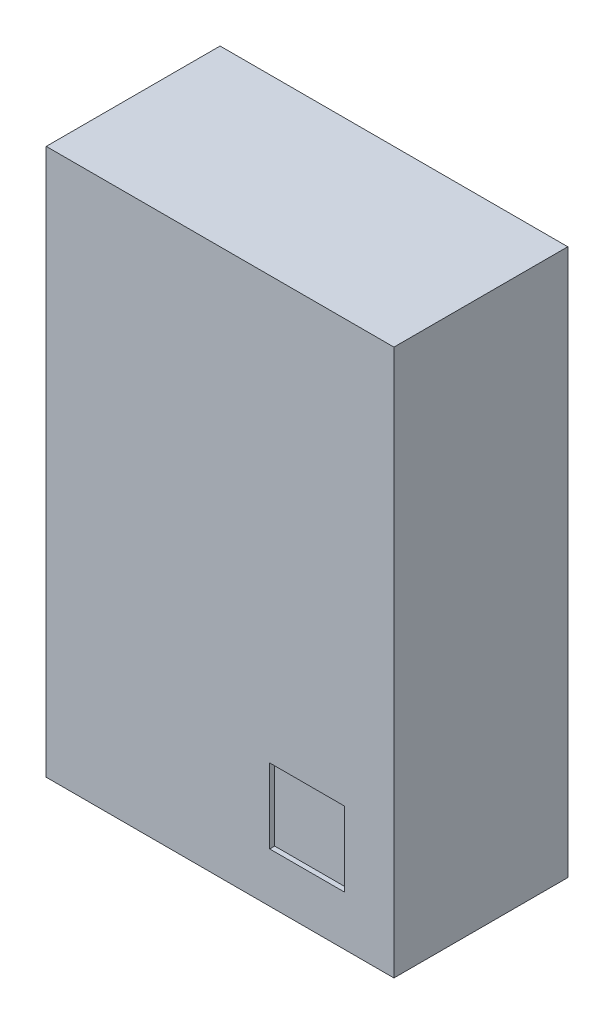
ISO-10303-21;
HEADER;
FILE_DESCRIPTION(('STEP AP214'),'2;1');
FILE_NAME('part.step','',(''),(''),'','','');
FILE_SCHEMA(('AUTOMOTIVE_DESIGN { 1 0 10303 214 1 1 1 1 }'));
ENDSEC;
DATA;
#1=APPLICATION_CONTEXT('core data for automotive mechanical design processes');
#2=APPLICATION_PROTOCOL_DEFINITION('international standard','automotive_design',2000,#1);
#3=PRODUCT_CONTEXT('',#1,'mechanical');
#4=PRODUCT('Part','Part','',(#3));
#5=PRODUCT_RELATED_PRODUCT_CATEGORY('part','',(#4));
#6=PRODUCT_DEFINITION_FORMATION('','',#4);
#7=PRODUCT_DEFINITION_CONTEXT('part definition',#1,'design');
#8=PRODUCT_DEFINITION('design','',#6,#7);
#9=PRODUCT_DEFINITION_SHAPE('','',#8);
#10=(LENGTH_UNIT() NAMED_UNIT(*) SI_UNIT(.MILLI.,.METRE.));
#11=(NAMED_UNIT(*) PLANE_ANGLE_UNIT() SI_UNIT($,.RADIAN.));
#12=(NAMED_UNIT(*) SI_UNIT($,.STERADIAN.) SOLID_ANGLE_UNIT());
#13=UNCERTAINTY_MEASURE_WITH_UNIT(LENGTH_MEASURE(1.E-05),#10,'distance_accuracy_value','');
#14=(GEOMETRIC_REPRESENTATION_CONTEXT(3) GLOBAL_UNCERTAINTY_ASSIGNED_CONTEXT((#13)) GLOBAL_UNIT_ASSIGNED_CONTEXT((#10,
#11,#12)) REPRESENTATION_CONTEXT('',''));
#15=CARTESIAN_POINT('',(0.,0.,0.));
#16=DIRECTION('',(0.,0.,1.));
#17=DIRECTION('',(1.,0.,0.));
#18=AXIS2_PLACEMENT_3D('',#15,#16,#17);
#19=CARTESIAN_POINT('',(0.,0.,0.));
#20=DIRECTION('',(0.,0.,1.));
#21=DIRECTION('',(1.,0.,0.));
#22=AXIS2_PLACEMENT_3D('',#19,#20,#21);
#23=PLANE('',#22);
#24=DIRECTION('',(0.,1.,0.));
#25=VECTOR('',#24,1.);
#26=CARTESIAN_POINT('',(-0.3,0.1,0.));
#27=LINE('',#26,#25);
#28=CARTESIAN_POINT('',(-0.3,-0.1,0.));
#29=VERTEX_POINT('',#28);
#30=CARTESIAN_POINT('',(-0.3,0.1,0.));
#31=VERTEX_POINT('',#30);
#32=EDGE_CURVE('E383',#29,#31,#27,.T.);
#33=ORIENTED_EDGE('',*,*,#32,.F.);
#34=DIRECTION('',(-1.,0.,0.));
#35=VECTOR('',#34,1.);
#36=CARTESIAN_POINT('',(-0.3,-0.1,0.));
#37=LINE('',#36,#35);
#38=CARTESIAN_POINT('',(-0.0999999999999999,-0.1,0.));
#39=VERTEX_POINT('',#38);
#40=EDGE_CURVE('E370',#39,#29,#37,.T.);
#41=ORIENTED_EDGE('',*,*,#40,.F.);
#42=DIRECTION('',(0.,-1.,0.));
#43=VECTOR('',#42,1.);
#44=CARTESIAN_POINT('',(-0.1,0.1,0.));
#45=LINE('',#44,#43);
#46=CARTESIAN_POINT('',(-0.1,0.1,0.));
#47=VERTEX_POINT('',#46);
#48=EDGE_CURVE('E374',#47,#39,#45,.T.);
#49=ORIENTED_EDGE('',*,*,#48,.F.);
#50=DIRECTION('',(1.,0.,0.));
#51=VECTOR('',#50,1.);
#52=CARTESIAN_POINT('',(-0.3,0.1,0.));
#53=LINE('',#52,#51);
#54=EDGE_CURVE('E379',#31,#47,#53,.T.);
#55=ORIENTED_EDGE('',*,*,#54,.F.);
#56=EDGE_LOOP('',(#33,#41,#49,#55));
#57=FACE_BOUND('',#56,.T.);
#58=DIRECTION('',(0.,-1.,0.));
#59=VECTOR('',#58,1.);
#60=CARTESIAN_POINT('',(0.3,-0.5,0.));
#61=LINE('',#60,#59);
#62=CARTESIAN_POINT('',(0.3,-0.3,0.));
#63=VERTEX_POINT('',#62);
#64=CARTESIAN_POINT('',(0.3,-0.5,0.));
#65=VERTEX_POINT('',#64);
#66=EDGE_CURVE('E473',#63,#65,#61,.T.);
#67=ORIENTED_EDGE('',*,*,#66,.F.);
#68=DIRECTION('',(1.,0.,0.));
#69=VECTOR('',#68,1.);
#70=CARTESIAN_POINT('',(0.3,-0.3,0.));
#71=LINE('',#70,#69);
#72=CARTESIAN_POINT('',(0.0999999999999999,-0.3,0.));
#73=VERTEX_POINT('',#72);
#74=EDGE_CURVE('E460',#73,#63,#71,.T.);
#75=ORIENTED_EDGE('',*,*,#74,.F.);
#76=DIRECTION('',(0.,1.,0.));
#77=VECTOR('',#76,1.);
#78=CARTESIAN_POINT('',(0.0999999999999998,-0.5,0.));
#79=LINE('',#78,#77);
#80=CARTESIAN_POINT('',(0.0999999999999998,-0.5,0.));
#81=VERTEX_POINT('',#80);
#82=EDGE_CURVE('E464',#81,#73,#79,.T.);
#83=ORIENTED_EDGE('',*,*,#82,.F.);
#84=DIRECTION('',(-1.,0.,0.));
#85=VECTOR('',#84,1.);
#86=CARTESIAN_POINT('',(0.3,-0.5,0.));
#87=LINE('',#86,#85);
#88=EDGE_CURVE('E469',#65,#81,#87,.T.);
#89=ORIENTED_EDGE('',*,*,#88,.F.);
#90=EDGE_LOOP('',(#67,#75,#83,#89));
#91=FACE_BOUND('',#90,.T.);
#92=DIRECTION('',(0.,1.,0.));
#93=VECTOR('',#92,1.);
#94=CARTESIAN_POINT('',(0.1,0.5,0.));
#95=LINE('',#94,#93);
#96=CARTESIAN_POINT('',(0.1,0.3,0.));
#97=VERTEX_POINT('',#96);
#98=CARTESIAN_POINT('',(0.1,0.5,0.));
#99=VERTEX_POINT('',#98);
#100=EDGE_CURVE('E522',#97,#99,#95,.T.);
#101=ORIENTED_EDGE('',*,*,#100,.F.);
#102=DIRECTION('',(-1.,0.,0.));
#103=VECTOR('',#102,1.);
#104=CARTESIAN_POINT('',(0.3,0.3,0.));
#105=LINE('',#104,#103);
#106=CARTESIAN_POINT('',(0.3,0.3,0.));
#107=VERTEX_POINT('',#106);
#108=EDGE_CURVE('E539',#107,#97,#105,.T.);
#109=ORIENTED_EDGE('',*,*,#108,.F.);
#110=DIRECTION('',(0.,-1.,0.));
#111=VECTOR('',#110,1.);
#112=CARTESIAN_POINT('',(0.3,0.5,0.));
#113=LINE('',#112,#111);
#114=CARTESIAN_POINT('',(0.3,0.5,0.));
#115=VERTEX_POINT('',#114);
#116=EDGE_CURVE('E556',#115,#107,#113,.T.);
#117=ORIENTED_EDGE('',*,*,#116,.F.);
#118=DIRECTION('',(1.,0.,0.));
#119=VECTOR('',#118,1.);
#120=CARTESIAN_POINT('',(0.3,0.5,0.));
#121=LINE('',#120,#119);
#122=EDGE_CURVE('E552',#99,#115,#121,.T.);
#123=ORIENTED_EDGE('',*,*,#122,.F.);
#124=EDGE_LOOP('',(#101,#109,#117,#123));
#125=FACE_BOUND('',#124,.T.);
#126=DIRECTION('',(0.,1.,0.));
#127=VECTOR('',#126,1.);
#128=CARTESIAN_POINT('',(0.35,0.55,0.));
#129=LINE('',#128,#127);
#130=CARTESIAN_POINT('',(0.35,-0.55,0.));
#131=VERTEX_POINT('',#130);
#132=CARTESIAN_POINT('',(0.35,0.55,0.));
#133=VERTEX_POINT('',#132);
#134=EDGE_CURVE('E578',#131,#133,#129,.T.);
#135=ORIENTED_EDGE('',*,*,#134,.F.);
#136=DIRECTION('',(1.,0.,0.));
#137=VECTOR('',#136,1.);
#138=CARTESIAN_POINT('',(-0.35,-0.55,0.));
#139=LINE('',#138,#137);
#140=CARTESIAN_POINT('',(-0.35,-0.55,0.));
#141=VERTEX_POINT('',#140);
#142=EDGE_CURVE('E584',#141,#131,#139,.T.);
#143=ORIENTED_EDGE('',*,*,#142,.F.);
#144=DIRECTION('',(0.,-1.,0.));
#145=VECTOR('',#144,1.);
#146=CARTESIAN_POINT('',(-0.35,0.55,0.));
#147=LINE('',#146,#145);
#148=CARTESIAN_POINT('',(-0.35,0.55,0.));
#149=VERTEX_POINT('',#148);
#150=EDGE_CURVE('E600',#149,#141,#147,.T.);
#151=ORIENTED_EDGE('',*,*,#150,.F.);
#152=DIRECTION('',(-1.,0.,0.));
#153=VECTOR('',#152,1.);
#154=CARTESIAN_POINT('',(-0.35,0.55,0.));
#155=LINE('',#154,#153);
#156=EDGE_CURVE('E597',#133,#149,#155,.T.);
#157=ORIENTED_EDGE('',*,*,#156,.F.);
#158=EDGE_LOOP('',(#135,#143,#151,#157));
#159=FACE_BOUND('',#158,.T.);
#160=DIRECTION('',(0.,1.,0.));
#161=VECTOR('',#160,1.);
#162=CARTESIAN_POINT('',(0.1,0.1,0.));
#163=LINE('',#162,#161);
#164=CARTESIAN_POINT('',(0.0999999999999999,-0.1,0.));
#165=VERTEX_POINT('',#164);
#166=CARTESIAN_POINT('',(0.1,0.1,0.));
#167=VERTEX_POINT('',#166);
#168=EDGE_CURVE('E518',#165,#167,#163,.T.);
#169=ORIENTED_EDGE('',*,*,#168,.F.);
#170=DIRECTION('',(-1.,0.,0.));
#171=VECTOR('',#170,1.);
#172=CARTESIAN_POINT('',(0.3,-0.1,0.));
#173=LINE('',#172,#171);
#174=CARTESIAN_POINT('',(0.3,-0.1,0.));
#175=VERTEX_POINT('',#174);
#176=EDGE_CURVE('E505',#175,#165,#173,.T.);
#177=ORIENTED_EDGE('',*,*,#176,.F.);
#178=DIRECTION('',(0.,-1.,0.));
#179=VECTOR('',#178,1.);
#180=CARTESIAN_POINT('',(0.3,0.1,0.));
#181=LINE('',#180,#179);
#182=CARTESIAN_POINT('',(0.3,0.1,0.));
#183=VERTEX_POINT('',#182);
#184=EDGE_CURVE('E509',#183,#175,#181,.T.);
#185=ORIENTED_EDGE('',*,*,#184,.F.);
#186=DIRECTION('',(1.,0.,0.));
#187=VECTOR('',#186,1.);
#188=CARTESIAN_POINT('',(0.3,0.1,0.));
#189=LINE('',#188,#187);
#190=EDGE_CURVE('E514',#167,#183,#189,.T.);
#191=ORIENTED_EDGE('',*,*,#190,.F.);
#192=EDGE_LOOP('',(#169,#177,#185,#191));
#193=FACE_BOUND('',#192,.T.);
#194=DIRECTION('',(-1.,0.,0.));
#195=VECTOR('',#194,1.);
#196=CARTESIAN_POINT('',(-0.3,-0.5,0.));
#197=LINE('',#196,#195);
#198=CARTESIAN_POINT('',(-0.0999999999999998,-0.5,0.));
#199=VERTEX_POINT('',#198);
#200=CARTESIAN_POINT('',(-0.3,-0.5,0.));
#201=VERTEX_POINT('',#200);
#202=EDGE_CURVE('E428',#199,#201,#197,.T.);
#203=ORIENTED_EDGE('',*,*,#202,.F.);
#204=DIRECTION('',(0.,-1.,0.));
#205=VECTOR('',#204,1.);
#206=CARTESIAN_POINT('',(-0.0999999999999998,-0.5,0.));
#207=LINE('',#206,#205);
#208=CARTESIAN_POINT('',(-0.0999999999999999,-0.3,0.));
#209=VERTEX_POINT('',#208);
#210=EDGE_CURVE('E415',#209,#199,#207,.T.);
#211=ORIENTED_EDGE('',*,*,#210,.F.);
#212=DIRECTION('',(1.,0.,0.));
#213=VECTOR('',#212,1.);
#214=CARTESIAN_POINT('',(-0.3,-0.3,0.));
#215=LINE('',#214,#213);
#216=CARTESIAN_POINT('',(-0.3,-0.3,0.));
#217=VERTEX_POINT('',#216);
#218=EDGE_CURVE('E419',#217,#209,#215,.T.);
#219=ORIENTED_EDGE('',*,*,#218,.F.);
#220=DIRECTION('',(0.,1.,0.));
#221=VECTOR('',#220,1.);
#222=CARTESIAN_POINT('',(-0.3,-0.5,0.));
#223=LINE('',#222,#221);
#224=EDGE_CURVE('E424',#201,#217,#223,.T.);
#225=ORIENTED_EDGE('',*,*,#224,.F.);
#226=EDGE_LOOP('',(#203,#211,#219,#225));
#227=FACE_BOUND('',#226,.T.);
#228=DIRECTION('',(0.,1.,0.));
#229=VECTOR('',#228,1.);
#230=CARTESIAN_POINT('',(-0.3,0.5,0.));
#231=LINE('',#230,#229);
#232=CARTESIAN_POINT('',(-0.3,0.3,0.));
#233=VERTEX_POINT('',#232);
#234=CARTESIAN_POINT('',(-0.3,0.5,0.));
#235=VERTEX_POINT('',#234);
#236=EDGE_CURVE('E338',#233,#235,#231,.T.);
#237=ORIENTED_EDGE('',*,*,#236,.F.);
#238=DIRECTION('',(-1.,0.,0.));
#239=VECTOR('',#238,1.);
#240=CARTESIAN_POINT('',(-0.3,0.3,0.));
#241=LINE('',#240,#239);
#242=CARTESIAN_POINT('',(-0.1,0.3,0.));
#243=VERTEX_POINT('',#242);
#244=EDGE_CURVE('E327',#243,#233,#241,.T.);
#245=ORIENTED_EDGE('',*,*,#244,.F.);
#246=DIRECTION('',(0.,-1.,0.));
#247=VECTOR('',#246,1.);
#248=CARTESIAN_POINT('',(-0.1,0.5,0.));
#249=LINE('',#248,#247);
#250=CARTESIAN_POINT('',(-0.1,0.5,0.));
#251=VERTEX_POINT('',#250);
#252=EDGE_CURVE('E331',#251,#243,#249,.T.);
#253=ORIENTED_EDGE('',*,*,#252,.F.);
#254=DIRECTION('',(1.,0.,0.));
#255=VECTOR('',#254,1.);
#256=CARTESIAN_POINT('',(-0.3,0.5,0.));
#257=LINE('',#256,#255);
#258=EDGE_CURVE('E75',#235,#251,#257,.T.);
#259=ORIENTED_EDGE('',*,*,#258,.F.);
#260=EDGE_LOOP('',(#237,#245,#253,#259));
#261=FACE_BOUND('',#260,.T.);
#262=ADVANCED_FACE('F51',(#57,#91,#125,#159,#193,#227,#261),#23,.F.);
#263=CARTESIAN_POINT('',(0.35,0.55,0.35));
#264=DIRECTION('',(-1.,0.,0.));
#265=DIRECTION('',(0.,-1.,0.));
#266=AXIS2_PLACEMENT_3D('',#263,#264,#265);
#267=PLANE('',#266);
#268=ORIENTED_EDGE('',*,*,#134,.T.);
#269=DIRECTION('',(0.,0.,-1.));
#270=VECTOR('',#269,1.);
#271=CARTESIAN_POINT('',(0.35,0.55,0.35));
#272=LINE('',#271,#270);
#273=CARTESIAN_POINT('',(0.35,0.55,0.35));
#274=VERTEX_POINT('',#273);
#275=EDGE_CURVE('E11',#274,#133,#272,.T.);
#276=ORIENTED_EDGE('',*,*,#275,.F.);
#277=DIRECTION('',(0.,1.,0.));
#278=VECTOR('',#277,1.);
#279=CARTESIAN_POINT('',(0.35,0.55,0.35));
#280=LINE('',#279,#278);
#281=CARTESIAN_POINT('',(0.35,-0.55,0.35));
#282=VERTEX_POINT('',#281);
#283=EDGE_CURVE('E579',#282,#274,#280,.T.);
#284=ORIENTED_EDGE('',*,*,#283,.F.);
#285=DIRECTION('',(0.,0.,-1.));
#286=VECTOR('',#285,1.);
#287=CARTESIAN_POINT('',(0.35,-0.55,0.35));
#288=LINE('',#287,#286);
#289=EDGE_CURVE('E593',#282,#131,#288,.T.);
#290=ORIENTED_EDGE('',*,*,#289,.T.);
#291=EDGE_LOOP('',(#268,#276,#284,#290));
#292=FACE_BOUND('',#291,.T.);
#293=ADVANCED_FACE('F53',(#292),#267,.F.);
#294=CARTESIAN_POINT('',(-0.35,0.55,0.35));
#295=DIRECTION('',(0.,-1.,0.));
#296=DIRECTION('',(0.,0.,-1.));
#297=AXIS2_PLACEMENT_3D('',#294,#295,#296);
#298=PLANE('',#297);
#299=ORIENTED_EDGE('',*,*,#156,.T.);
#300=DIRECTION('',(0.,0.,-1.));
#301=VECTOR('',#300,1.);
#302=CARTESIAN_POINT('',(-0.35,0.55,0.35));
#303=LINE('',#302,#301);
#304=CARTESIAN_POINT('',(-0.35,0.55,0.35));
#305=VERTEX_POINT('',#304);
#306=EDGE_CURVE('E60',#305,#149,#303,.T.);
#307=ORIENTED_EDGE('',*,*,#306,.F.);
#308=DIRECTION('',(-1.,0.,0.));
#309=VECTOR('',#308,1.);
#310=CARTESIAN_POINT('',(-0.35,0.55,0.35));
#311=LINE('',#310,#309);
#312=EDGE_CURVE('E583',#274,#305,#311,.T.);
#313=ORIENTED_EDGE('',*,*,#312,.F.);
#314=ORIENTED_EDGE('',*,*,#275,.T.);
#315=EDGE_LOOP('',(#299,#307,#313,#314));
#316=FACE_BOUND('',#315,.T.);
#317=ADVANCED_FACE('F633',(#316),#298,.F.);
#318=CARTESIAN_POINT('',(-0.35,0.55,0.35));
#319=DIRECTION('',(1.,0.,0.));
#320=DIRECTION('',(0.,1.,0.));
#321=AXIS2_PLACEMENT_3D('',#318,#319,#320);
#322=PLANE('',#321);
#323=ORIENTED_EDGE('',*,*,#150,.T.);
#324=DIRECTION('',(0.,0.,-1.));
#325=VECTOR('',#324,1.);
#326=CARTESIAN_POINT('',(-0.35,-0.55,0.35));
#327=LINE('',#326,#325);
#328=CARTESIAN_POINT('',(-0.35,-0.55,0.35));
#329=VERTEX_POINT('',#328);
#330=EDGE_CURVE('E608',#329,#141,#327,.T.);
#331=ORIENTED_EDGE('',*,*,#330,.F.);
#332=DIRECTION('',(0.,-1.,0.));
#333=VECTOR('',#332,1.);
#334=CARTESIAN_POINT('',(-0.35,0.55,0.35));
#335=LINE('',#334,#333);
#336=EDGE_CURVE('E587',#305,#329,#335,.T.);
#337=ORIENTED_EDGE('',*,*,#336,.F.);
#338=ORIENTED_EDGE('',*,*,#306,.T.);
#339=EDGE_LOOP('',(#323,#331,#337,#338));
#340=FACE_BOUND('',#339,.T.);
#341=ADVANCED_FACE('F617',(#340),#322,.F.);
#342=CARTESIAN_POINT('',(-0.35,-0.55,0.35));
#343=DIRECTION('',(0.,1.,0.));
#344=DIRECTION('',(0.,0.,1.));
#345=AXIS2_PLACEMENT_3D('',#342,#343,#344);
#346=PLANE('',#345);
#347=ORIENTED_EDGE('',*,*,#142,.T.);
#348=ORIENTED_EDGE('',*,*,#289,.F.);
#349=DIRECTION('',(1.,0.,0.));
#350=VECTOR('',#349,1.);
#351=CARTESIAN_POINT('',(-0.35,-0.55,0.35));
#352=LINE('',#351,#350);
#353=EDGE_CURVE('E590',#329,#282,#352,.T.);
#354=ORIENTED_EDGE('',*,*,#353,.F.);
#355=ORIENTED_EDGE('',*,*,#330,.T.);
#356=EDGE_LOOP('',(#347,#348,#354,#355));
#357=FACE_BOUND('',#356,.T.);
#358=ADVANCED_FACE('F626',(#357),#346,.F.);
#359=CARTESIAN_POINT('',(0.,0.,0.35));
#360=DIRECTION('',(0.,0.,1.));
#361=DIRECTION('',(1.,0.,0.));
#362=AXIS2_PLACEMENT_3D('',#359,#360,#361);
#363=PLANE('',#362);
#364=DIRECTION('',(0.,1.,0.));
#365=VECTOR('',#364,1.);
#366=CARTESIAN_POINT('',(0.25,-0.45,0.35));
#367=LINE('',#366,#365);
#368=CARTESIAN_POINT('',(0.25,-0.45,0.35));
#369=VERTEX_POINT('',#368);
#370=CARTESIAN_POINT('',(0.25,-0.3,0.35));
#371=VERTEX_POINT('',#370);
#372=EDGE_CURVE('E67',#369,#371,#367,.T.);
#373=ORIENTED_EDGE('',*,*,#372,.F.);
#374=DIRECTION('',(1.,0.,0.));
#375=VECTOR('',#374,1.);
#376=CARTESIAN_POINT('',(0.25,-0.45,0.35));
#377=LINE('',#376,#375);
#378=CARTESIAN_POINT('',(0.1,-0.45,0.35));
#379=VERTEX_POINT('',#378);
#380=EDGE_CURVE('E284',#379,#369,#377,.T.);
#381=ORIENTED_EDGE('',*,*,#380,.F.);
#382=DIRECTION('',(0.,-1.,0.));
#383=VECTOR('',#382,1.);
#384=CARTESIAN_POINT('',(0.1,-0.45,0.35));
#385=LINE('',#384,#383);
#386=CARTESIAN_POINT('',(0.1,-0.3,0.35));
#387=VERTEX_POINT('',#386);
#388=EDGE_CURVE('E288',#387,#379,#385,.T.);
#389=ORIENTED_EDGE('',*,*,#388,.F.);
#390=DIRECTION('',(-1.,0.,0.));
#391=VECTOR('',#390,1.);
#392=CARTESIAN_POINT('',(0.25,-0.3,0.35));
#393=LINE('',#392,#391);
#394=EDGE_CURVE('E297',#371,#387,#393,.T.);
#395=ORIENTED_EDGE('',*,*,#394,.F.);
#396=EDGE_LOOP('',(#373,#381,#389,#395));
#397=FACE_BOUND('',#396,.T.);
#398=ORIENTED_EDGE('',*,*,#283,.T.);
#399=ORIENTED_EDGE('',*,*,#312,.T.);
#400=ORIENTED_EDGE('',*,*,#336,.T.);
#401=ORIENTED_EDGE('',*,*,#353,.T.);
#402=EDGE_LOOP('',(#398,#399,#400,#401));
#403=FACE_BOUND('',#402,.T.);
#404=ADVANCED_FACE('F632',(#397,#403),#363,.T.);
#405=CARTESIAN_POINT('',(0.1,0.5,-0.02));
#406=DIRECTION('',(1.,0.,0.));
#407=DIRECTION('',(0.,1.,0.));
#408=AXIS2_PLACEMENT_3D('',#405,#406,#407);
#409=PLANE('',#408);
#410=ORIENTED_EDGE('',*,*,#100,.T.);
#411=DIRECTION('',(0.,0.,1.));
#412=VECTOR('',#411,1.);
#413=CARTESIAN_POINT('',(0.1,0.5,-0.02));
#414=LINE('',#413,#412);
#415=CARTESIAN_POINT('',(0.1,0.5,-0.02));
#416=VERTEX_POINT('',#415);
#417=EDGE_CURVE('E574',#416,#99,#414,.T.);
#418=ORIENTED_EDGE('',*,*,#417,.F.);
#419=DIRECTION('',(0.,1.,0.));
#420=VECTOR('',#419,1.);
#421=CARTESIAN_POINT('',(0.1,0.5,-0.02));
#422=LINE('',#421,#420);
#423=CARTESIAN_POINT('',(0.1,0.3,-0.02));
#424=VERTEX_POINT('',#423);
#425=EDGE_CURVE('E534',#424,#416,#422,.T.);
#426=ORIENTED_EDGE('',*,*,#425,.F.);
#427=DIRECTION('',(0.,0.,1.));
#428=VECTOR('',#427,1.);
#429=CARTESIAN_POINT('',(0.1,0.3,-0.02));
#430=LINE('',#429,#428);
#431=EDGE_CURVE('E548',#424,#97,#430,.T.);
#432=ORIENTED_EDGE('',*,*,#431,.T.);
#433=EDGE_LOOP('',(#410,#418,#426,#432));
#434=FACE_BOUND('',#433,.T.);
#435=ADVANCED_FACE('F654',(#434),#409,.F.);
#436=CARTESIAN_POINT('',(0.3,0.5,-0.02));
#437=DIRECTION('',(0.,-1.,0.));
#438=DIRECTION('',(1.,0.,0.));
#439=AXIS2_PLACEMENT_3D('',#436,#437,#438);
#440=PLANE('',#439);
#441=ORIENTED_EDGE('',*,*,#122,.T.);
#442=DIRECTION('',(0.,0.,1.));
#443=VECTOR('',#442,1.);
#444=CARTESIAN_POINT('',(0.3,0.5,-0.02));
#445=LINE('',#444,#443);
#446=CARTESIAN_POINT('',(0.3,0.5,-0.02));
#447=VERTEX_POINT('',#446);
#448=EDGE_CURVE('E570',#447,#115,#445,.T.);
#449=ORIENTED_EDGE('',*,*,#448,.F.);
#450=DIRECTION('',(1.,0.,0.));
#451=VECTOR('',#450,1.);
#452=CARTESIAN_POINT('',(0.3,0.5,-0.02));
#453=LINE('',#452,#451);
#454=EDGE_CURVE('E538',#416,#447,#453,.T.);
#455=ORIENTED_EDGE('',*,*,#454,.F.);
#456=ORIENTED_EDGE('',*,*,#417,.T.);
#457=EDGE_LOOP('',(#441,#449,#455,#456));
#458=FACE_BOUND('',#457,.T.);
#459=ADVANCED_FACE('F661',(#458),#440,.F.);
#460=CARTESIAN_POINT('',(0.3,0.5,-0.02));
#461=DIRECTION('',(-1.,0.,0.));
#462=DIRECTION('',(0.,-1.,0.));
#463=AXIS2_PLACEMENT_3D('',#460,#461,#462);
#464=PLANE('',#463);
#465=ORIENTED_EDGE('',*,*,#116,.T.);
#466=DIRECTION('',(0.,0.,1.));
#467=VECTOR('',#466,1.);
#468=CARTESIAN_POINT('',(0.3,0.3,-0.02));
#469=LINE('',#468,#467);
#470=CARTESIAN_POINT('',(0.3,0.3,-0.02));
#471=VERTEX_POINT('',#470);
#472=EDGE_CURVE('E566',#471,#107,#469,.T.);
#473=ORIENTED_EDGE('',*,*,#472,.F.);
#474=DIRECTION('',(0.,-1.,0.));
#475=VECTOR('',#474,1.);
#476=CARTESIAN_POINT('',(0.3,0.5,-0.02));
#477=LINE('',#476,#475);
#478=EDGE_CURVE('E542',#447,#471,#477,.T.);
#479=ORIENTED_EDGE('',*,*,#478,.F.);
#480=ORIENTED_EDGE('',*,*,#448,.T.);
#481=EDGE_LOOP('',(#465,#473,#479,#480));
#482=FACE_BOUND('',#481,.T.);
#483=ADVANCED_FACE('F788',(#482),#464,.F.);
#484=CARTESIAN_POINT('',(0.3,0.3,-0.02));
#485=DIRECTION('',(0.,1.,0.));
#486=DIRECTION('',(-1.,0.,0.));
#487=AXIS2_PLACEMENT_3D('',#484,#485,#486);
#488=PLANE('',#487);
#489=ORIENTED_EDGE('',*,*,#108,.T.);
#490=ORIENTED_EDGE('',*,*,#431,.F.);
#491=DIRECTION('',(-1.,0.,0.));
#492=VECTOR('',#491,1.);
#493=CARTESIAN_POINT('',(0.3,0.3,-0.02));
#494=LINE('',#493,#492);
#495=EDGE_CURVE('E545',#471,#424,#494,.T.);
#496=ORIENTED_EDGE('',*,*,#495,.F.);
#497=ORIENTED_EDGE('',*,*,#472,.T.);
#498=EDGE_LOOP('',(#489,#490,#496,#497));
#499=FACE_BOUND('',#498,.T.);
#500=ADVANCED_FACE('F784',(#499),#488,.F.);
#501=CARTESIAN_POINT('',(0.,0.,-0.02));
#502=DIRECTION('',(0.,0.,-1.));
#503=DIRECTION('',(-1.,0.,0.));
#504=AXIS2_PLACEMENT_3D('',#501,#502,#503);
#505=PLANE('',#504);
#506=ORIENTED_EDGE('',*,*,#425,.T.);
#507=ORIENTED_EDGE('',*,*,#454,.T.);
#508=ORIENTED_EDGE('',*,*,#478,.T.);
#509=ORIENTED_EDGE('',*,*,#495,.T.);
#510=EDGE_LOOP('',(#506,#507,#508,#509));
#511=FACE_BOUND('',#510,.T.);
#512=ADVANCED_FACE('F766',(#511),#505,.T.);
#513=CARTESIAN_POINT('',(0.1,0.1,-0.02));
#514=DIRECTION('',(1.,0.,0.));
#515=DIRECTION('',(0.,1.,0.));
#516=AXIS2_PLACEMENT_3D('',#513,#514,#515);
#517=PLANE('',#516);
#518=ORIENTED_EDGE('',*,*,#168,.T.);
#519=DIRECTION('',(0.,0.,1.));
#520=VECTOR('',#519,1.);
#521=CARTESIAN_POINT('',(0.1,0.1,-0.02));
#522=LINE('',#521,#520);
#523=CARTESIAN_POINT('',(0.1,0.1,-0.02));
#524=VERTEX_POINT('',#523);
#525=EDGE_CURVE('E477',#524,#167,#522,.T.);
#526=ORIENTED_EDGE('',*,*,#525,.F.);
#527=DIRECTION('',(0.,1.,0.));
#528=VECTOR('',#527,1.);
#529=CARTESIAN_POINT('',(0.1,0.1,-0.02));
#530=LINE('',#529,#528);
#531=CARTESIAN_POINT('',(0.0999999999999999,-0.1,-0.02));
#532=VERTEX_POINT('',#531);
#533=EDGE_CURVE('E510',#532,#524,#530,.T.);
#534=ORIENTED_EDGE('',*,*,#533,.F.);
#535=DIRECTION('',(0.,0.,1.));
#536=VECTOR('',#535,1.);
#537=CARTESIAN_POINT('',(0.0999999999999999,-0.1,-0.02));
#538=LINE('',#537,#536);
#539=EDGE_CURVE('E500',#532,#165,#538,.T.);
#540=ORIENTED_EDGE('',*,*,#539,.T.);
#541=EDGE_LOOP('',(#518,#526,#534,#540));
#542=FACE_BOUND('',#541,.T.);
#543=ADVANCED_FACE('F762',(#542),#517,.F.);
#544=CARTESIAN_POINT('',(0.3,0.1,-0.02));
#545=DIRECTION('',(0.,-1.,0.));
#546=DIRECTION('',(0.,0.,-1.));
#547=AXIS2_PLACEMENT_3D('',#544,#545,#546);
#548=PLANE('',#547);
#549=ORIENTED_EDGE('',*,*,#190,.T.);
#550=DIRECTION('',(0.,0.,1.));
#551=VECTOR('',#550,1.);
#552=CARTESIAN_POINT('',(0.3,0.1,-0.02));
#553=LINE('',#552,#551);
#554=CARTESIAN_POINT('',(0.3,0.1,-0.02));
#555=VERTEX_POINT('',#554);
#556=EDGE_CURVE('E492',#555,#183,#553,.T.);
#557=ORIENTED_EDGE('',*,*,#556,.F.);
#558=DIRECTION('',(1.,0.,0.));
#559=VECTOR('',#558,1.);
#560=CARTESIAN_POINT('',(0.3,0.1,-0.02));
#561=LINE('',#560,#559);
#562=EDGE_CURVE('E528',#524,#555,#561,.T.);
#563=ORIENTED_EDGE('',*,*,#562,.F.);
#564=ORIENTED_EDGE('',*,*,#525,.T.);
#565=EDGE_LOOP('',(#549,#557,#563,#564));
#566=FACE_BOUND('',#565,.T.);
#567=ADVANCED_FACE('F765',(#566),#548,.F.);
#568=CARTESIAN_POINT('',(0.3,0.1,-0.02));
#569=DIRECTION('',(-1.,0.,0.));
#570=DIRECTION('',(0.,-1.,0.));
#571=AXIS2_PLACEMENT_3D('',#568,#569,#570);
#572=PLANE('',#571);
#573=ORIENTED_EDGE('',*,*,#184,.T.);
#574=DIRECTION('',(0.,0.,1.));
#575=VECTOR('',#574,1.);
#576=CARTESIAN_POINT('',(0.3,-0.1,-0.02));
#577=LINE('',#576,#575);
#578=CARTESIAN_POINT('',(0.3,-0.1,-0.02));
#579=VERTEX_POINT('',#578);
#580=EDGE_CURVE('E496',#579,#175,#577,.T.);
#581=ORIENTED_EDGE('',*,*,#580,.F.);
#582=DIRECTION('',(0.,-1.,0.));
#583=VECTOR('',#582,1.);
#584=CARTESIAN_POINT('',(0.3,0.1,-0.02));
#585=LINE('',#584,#583);
#586=EDGE_CURVE('E525',#555,#579,#585,.T.);
#587=ORIENTED_EDGE('',*,*,#586,.F.);
#588=ORIENTED_EDGE('',*,*,#556,.T.);
#589=EDGE_LOOP('',(#573,#581,#587,#588));
#590=FACE_BOUND('',#589,.T.);
#591=ADVANCED_FACE('F770',(#590),#572,.F.);
#592=CARTESIAN_POINT('',(0.3,-0.1,-0.02));
#593=DIRECTION('',(0.,1.,0.));
#594=DIRECTION('',(0.,0.,1.));
#595=AXIS2_PLACEMENT_3D('',#592,#593,#594);
#596=PLANE('',#595);
#597=ORIENTED_EDGE('',*,*,#176,.T.);
#598=ORIENTED_EDGE('',*,*,#539,.F.);
#599=DIRECTION('',(-1.,0.,0.));
#600=VECTOR('',#599,1.);
#601=CARTESIAN_POINT('',(0.3,-0.1,-0.02));
#602=LINE('',#601,#600);
#603=EDGE_CURVE('E504',#579,#532,#602,.T.);
#604=ORIENTED_EDGE('',*,*,#603,.F.);
#605=ORIENTED_EDGE('',*,*,#580,.T.);
#606=EDGE_LOOP('',(#597,#598,#604,#605));
#607=FACE_BOUND('',#606,.T.);
#608=ADVANCED_FACE('F774',(#607),#596,.F.);
#609=CARTESIAN_POINT('',(0.,0.,-0.02));
#610=DIRECTION('',(0.,0.,-1.));
#611=DIRECTION('',(-1.,0.,0.));
#612=AXIS2_PLACEMENT_3D('',#609,#610,#611);
#613=PLANE('',#612);
#614=ORIENTED_EDGE('',*,*,#533,.T.);
#615=ORIENTED_EDGE('',*,*,#562,.T.);
#616=ORIENTED_EDGE('',*,*,#586,.T.);
#617=ORIENTED_EDGE('',*,*,#603,.T.);
#618=EDGE_LOOP('',(#614,#615,#616,#617));
#619=FACE_BOUND('',#618,.T.);
#620=ADVANCED_FACE('F746',(#619),#613,.T.);
#621=CARTESIAN_POINT('',(0.3,-0.5,-0.02));
#622=DIRECTION('',(-1.,0.,0.));
#623=DIRECTION('',(0.,-1.,0.));
#624=AXIS2_PLACEMENT_3D('',#621,#622,#623);
#625=PLANE('',#624);
#626=ORIENTED_EDGE('',*,*,#66,.T.);
#627=DIRECTION('',(0.,0.,1.));
#628=VECTOR('',#627,1.);
#629=CARTESIAN_POINT('',(0.3,-0.5,-0.02));
#630=LINE('',#629,#628);
#631=CARTESIAN_POINT('',(0.3,-0.5,-0.02));
#632=VERTEX_POINT('',#631);
#633=EDGE_CURVE('E432',#632,#65,#630,.T.);
#634=ORIENTED_EDGE('',*,*,#633,.F.);
#635=DIRECTION('',(0.,-1.,0.));
#636=VECTOR('',#635,1.);
#637=CARTESIAN_POINT('',(0.3,-0.5,-0.02));
#638=LINE('',#637,#636);
#639=CARTESIAN_POINT('',(0.3,-0.3,-0.02));
#640=VERTEX_POINT('',#639);
#641=EDGE_CURVE('E465',#640,#632,#638,.T.);
#642=ORIENTED_EDGE('',*,*,#641,.F.);
#643=DIRECTION('',(0.,0.,1.));
#644=VECTOR('',#643,1.);
#645=CARTESIAN_POINT('',(0.3,-0.3,-0.02));
#646=LINE('',#645,#644);
#647=EDGE_CURVE('E455',#640,#63,#646,.T.);
#648=ORIENTED_EDGE('',*,*,#647,.T.);
#649=EDGE_LOOP('',(#626,#634,#642,#648));
#650=FACE_BOUND('',#649,.T.);
#651=ADVANCED_FACE('F742',(#650),#625,.F.);
#652=CARTESIAN_POINT('',(0.3,-0.5,-0.02));
#653=DIRECTION('',(0.,1.,0.));
#654=DIRECTION('',(-1.,0.,0.));
#655=AXIS2_PLACEMENT_3D('',#652,#653,#654);
#656=PLANE('',#655);
#657=ORIENTED_EDGE('',*,*,#88,.T.);
#658=DIRECTION('',(0.,0.,1.));
#659=VECTOR('',#658,1.);
#660=CARTESIAN_POINT('',(0.0999999999999998,-0.5,-0.02));
#661=LINE('',#660,#659);
#662=CARTESIAN_POINT('',(0.0999999999999998,-0.5,-0.02));
#663=VERTEX_POINT('',#662);
#664=EDGE_CURVE('E447',#663,#81,#661,.T.);
#665=ORIENTED_EDGE('',*,*,#664,.F.);
#666=DIRECTION('',(-1.,0.,0.));
#667=VECTOR('',#666,1.);
#668=CARTESIAN_POINT('',(0.3,-0.5,-0.02));
#669=LINE('',#668,#667);
#670=EDGE_CURVE('E483',#632,#663,#669,.T.);
#671=ORIENTED_EDGE('',*,*,#670,.F.);
#672=ORIENTED_EDGE('',*,*,#633,.T.);
#673=EDGE_LOOP('',(#657,#665,#671,#672));
#674=FACE_BOUND('',#673,.T.);
#675=ADVANCED_FACE('F745',(#674),#656,.F.);
#676=CARTESIAN_POINT('',(0.0999999999999998,-0.5,-0.02));
#677=DIRECTION('',(1.,0.,0.));
#678=DIRECTION('',(0.,1.,0.));
#679=AXIS2_PLACEMENT_3D('',#676,#677,#678);
#680=PLANE('',#679);
#681=ORIENTED_EDGE('',*,*,#82,.T.);
#682=DIRECTION('',(0.,0.,1.));
#683=VECTOR('',#682,1.);
#684=CARTESIAN_POINT('',(0.0999999999999999,-0.3,-0.02));
#685=LINE('',#684,#683);
#686=CARTESIAN_POINT('',(0.0999999999999999,-0.3,-0.02));
#687=VERTEX_POINT('',#686);
#688=EDGE_CURVE('E451',#687,#73,#685,.T.);
#689=ORIENTED_EDGE('',*,*,#688,.F.);
#690=DIRECTION('',(0.,1.,0.));
#691=VECTOR('',#690,1.);
#692=CARTESIAN_POINT('',(0.0999999999999998,-0.5,-0.02));
#693=LINE('',#692,#691);
#694=EDGE_CURVE('E480',#663,#687,#693,.T.);
#695=ORIENTED_EDGE('',*,*,#694,.F.);
#696=ORIENTED_EDGE('',*,*,#664,.T.);
#697=EDGE_LOOP('',(#681,#689,#695,#696));
#698=FACE_BOUND('',#697,.T.);
#699=ADVANCED_FACE('F750',(#698),#680,.F.);
#700=CARTESIAN_POINT('',(0.3,-0.3,-0.02));
#701=DIRECTION('',(0.,-1.,0.));
#702=DIRECTION('',(1.,0.,0.));
#703=AXIS2_PLACEMENT_3D('',#700,#701,#702);
#704=PLANE('',#703);
#705=ORIENTED_EDGE('',*,*,#74,.T.);
#706=ORIENTED_EDGE('',*,*,#647,.F.);
#707=DIRECTION('',(1.,0.,0.));
#708=VECTOR('',#707,1.);
#709=CARTESIAN_POINT('',(0.3,-0.3,-0.02));
#710=LINE('',#709,#708);
#711=EDGE_CURVE('E459',#687,#640,#710,.T.);
#712=ORIENTED_EDGE('',*,*,#711,.F.);
#713=ORIENTED_EDGE('',*,*,#688,.T.);
#714=EDGE_LOOP('',(#705,#706,#712,#713));
#715=FACE_BOUND('',#714,.T.);
#716=ADVANCED_FACE('F754',(#715),#704,.F.);
#717=CARTESIAN_POINT('',(0.,0.,-0.02));
#718=DIRECTION('',(0.,0.,1.));
#719=DIRECTION('',(1.,0.,0.));
#720=AXIS2_PLACEMENT_3D('',#717,#718,#719);
#721=PLANE('',#720);
#722=ORIENTED_EDGE('',*,*,#641,.T.);
#723=ORIENTED_EDGE('',*,*,#670,.T.);
#724=ORIENTED_EDGE('',*,*,#694,.T.);
#725=ORIENTED_EDGE('',*,*,#711,.T.);
#726=EDGE_LOOP('',(#722,#723,#724,#725));
#727=FACE_BOUND('',#726,.T.);
#728=ADVANCED_FACE('F726',(#727),#721,.F.);
#729=CARTESIAN_POINT('',(-0.3,-0.5,-0.02));
#730=DIRECTION('',(0.,1.,0.));
#731=DIRECTION('',(-1.,0.,0.));
#732=AXIS2_PLACEMENT_3D('',#729,#730,#731);
#733=PLANE('',#732);
#734=ORIENTED_EDGE('',*,*,#202,.T.);
#735=DIRECTION('',(0.,0.,1.));
#736=VECTOR('',#735,1.);
#737=CARTESIAN_POINT('',(-0.3,-0.5,-0.02));
#738=LINE('',#737,#736);
#739=CARTESIAN_POINT('',(-0.3,-0.5,-0.02));
#740=VERTEX_POINT('',#739);
#741=EDGE_CURVE('E387',#740,#201,#738,.T.);
#742=ORIENTED_EDGE('',*,*,#741,.F.);
#743=DIRECTION('',(-1.,0.,0.));
#744=VECTOR('',#743,1.);
#745=CARTESIAN_POINT('',(-0.3,-0.5,-0.02));
#746=LINE('',#745,#744);
#747=CARTESIAN_POINT('',(-0.0999999999999998,-0.5,-0.02));
#748=VERTEX_POINT('',#747);
#749=EDGE_CURVE('E420',#748,#740,#746,.T.);
#750=ORIENTED_EDGE('',*,*,#749,.F.);
#751=DIRECTION('',(0.,0.,1.));
#752=VECTOR('',#751,1.);
#753=CARTESIAN_POINT('',(-0.0999999999999998,-0.5,-0.02));
#754=LINE('',#753,#752);
#755=EDGE_CURVE('E410',#748,#199,#754,.T.);
#756=ORIENTED_EDGE('',*,*,#755,.T.);
#757=EDGE_LOOP('',(#734,#742,#750,#756));
#758=FACE_BOUND('',#757,.T.);
#759=ADVANCED_FACE('F722',(#758),#733,.F.);
#760=CARTESIAN_POINT('',(-0.3,-0.5,-0.02));
#761=DIRECTION('',(1.,0.,0.));
#762=DIRECTION('',(0.,1.,0.));
#763=AXIS2_PLACEMENT_3D('',#760,#761,#762);
#764=PLANE('',#763);
#765=ORIENTED_EDGE('',*,*,#224,.T.);
#766=DIRECTION('',(0.,0.,1.));
#767=VECTOR('',#766,1.);
#768=CARTESIAN_POINT('',(-0.3,-0.3,-0.02));
#769=LINE('',#768,#767);
#770=CARTESIAN_POINT('',(-0.3,-0.3,-0.02));
#771=VERTEX_POINT('',#770);
#772=EDGE_CURVE('E402',#771,#217,#769,.T.);
#773=ORIENTED_EDGE('',*,*,#772,.F.);
#774=DIRECTION('',(0.,1.,0.));
#775=VECTOR('',#774,1.);
#776=CARTESIAN_POINT('',(-0.3,-0.5,-0.02));
#777=LINE('',#776,#775);
#778=EDGE_CURVE('E438',#740,#771,#777,.T.);
#779=ORIENTED_EDGE('',*,*,#778,.F.);
#780=ORIENTED_EDGE('',*,*,#741,.T.);
#781=EDGE_LOOP('',(#765,#773,#779,#780));
#782=FACE_BOUND('',#781,.T.);
#783=ADVANCED_FACE('F725',(#782),#764,.F.);
#784=CARTESIAN_POINT('',(-0.3,-0.3,-0.02));
#785=DIRECTION('',(0.,-1.,0.));
#786=DIRECTION('',(1.,0.,0.));
#787=AXIS2_PLACEMENT_3D('',#784,#785,#786);
#788=PLANE('',#787);
#789=ORIENTED_EDGE('',*,*,#218,.T.);
#790=DIRECTION('',(0.,0.,1.));
#791=VECTOR('',#790,1.);
#792=CARTESIAN_POINT('',(-0.0999999999999999,-0.3,-0.02));
#793=LINE('',#792,#791);
#794=CARTESIAN_POINT('',(-0.0999999999999999,-0.3,-0.02));
#795=VERTEX_POINT('',#794);
#796=EDGE_CURVE('E406',#795,#209,#793,.T.);
#797=ORIENTED_EDGE('',*,*,#796,.F.);
#798=DIRECTION('',(1.,0.,0.));
#799=VECTOR('',#798,1.);
#800=CARTESIAN_POINT('',(-0.3,-0.3,-0.02));
#801=LINE('',#800,#799);
#802=EDGE_CURVE('E435',#771,#795,#801,.T.);
#803=ORIENTED_EDGE('',*,*,#802,.F.);
#804=ORIENTED_EDGE('',*,*,#772,.T.);
#805=EDGE_LOOP('',(#789,#797,#803,#804));
#806=FACE_BOUND('',#805,.T.);
#807=ADVANCED_FACE('F730',(#806),#788,.F.);
#808=CARTESIAN_POINT('',(-0.0999999999999998,-0.5,-0.02));
#809=DIRECTION('',(-1.,0.,0.));
#810=DIRECTION('',(0.,-1.,0.));
#811=AXIS2_PLACEMENT_3D('',#808,#809,#810);
#812=PLANE('',#811);
#813=ORIENTED_EDGE('',*,*,#210,.T.);
#814=ORIENTED_EDGE('',*,*,#755,.F.);
#815=DIRECTION('',(0.,-1.,0.));
#816=VECTOR('',#815,1.);
#817=CARTESIAN_POINT('',(-0.0999999999999998,-0.5,-0.02));
#818=LINE('',#817,#816);
#819=EDGE_CURVE('E414',#795,#748,#818,.T.);
#820=ORIENTED_EDGE('',*,*,#819,.F.);
#821=ORIENTED_EDGE('',*,*,#796,.T.);
#822=EDGE_LOOP('',(#813,#814,#820,#821));
#823=FACE_BOUND('',#822,.T.);
#824=ADVANCED_FACE('F734',(#823),#812,.F.);
#825=CARTESIAN_POINT('',(0.,0.,-0.02));
#826=DIRECTION('',(0.,0.,1.));
#827=DIRECTION('',(1.,0.,0.));
#828=AXIS2_PLACEMENT_3D('',#825,#826,#827);
#829=PLANE('',#828);
#830=ORIENTED_EDGE('',*,*,#749,.T.);
#831=ORIENTED_EDGE('',*,*,#778,.T.);
#832=ORIENTED_EDGE('',*,*,#802,.T.);
#833=ORIENTED_EDGE('',*,*,#819,.T.);
#834=EDGE_LOOP('',(#830,#831,#832,#833));
#835=FACE_BOUND('',#834,.T.);
#836=ADVANCED_FACE('F706',(#835),#829,.F.);
#837=CARTESIAN_POINT('',(-0.3,0.1,-0.02));
#838=DIRECTION('',(1.,0.,0.));
#839=DIRECTION('',(0.,1.,0.));
#840=AXIS2_PLACEMENT_3D('',#837,#838,#839);
#841=PLANE('',#840);
#842=ORIENTED_EDGE('',*,*,#32,.T.);
#843=DIRECTION('',(0.,0.,1.));
#844=VECTOR('',#843,1.);
#845=CARTESIAN_POINT('',(-0.3,0.1,-0.02));
#846=LINE('',#845,#844);
#847=CARTESIAN_POINT('',(-0.3,0.1,-0.02));
#848=VERTEX_POINT('',#847);
#849=EDGE_CURVE('E342',#848,#31,#846,.T.);
#850=ORIENTED_EDGE('',*,*,#849,.F.);
#851=DIRECTION('',(0.,1.,0.));
#852=VECTOR('',#851,1.);
#853=CARTESIAN_POINT('',(-0.3,0.1,-0.02));
#854=LINE('',#853,#852);
#855=CARTESIAN_POINT('',(-0.3,-0.1,-0.02));
#856=VERTEX_POINT('',#855);
#857=EDGE_CURVE('E375',#856,#848,#854,.T.);
#858=ORIENTED_EDGE('',*,*,#857,.F.);
#859=DIRECTION('',(0.,0.,1.));
#860=VECTOR('',#859,1.);
#861=CARTESIAN_POINT('',(-0.3,-0.1,-0.02));
#862=LINE('',#861,#860);
#863=EDGE_CURVE('E365',#856,#29,#862,.T.);
#864=ORIENTED_EDGE('',*,*,#863,.T.);
#865=EDGE_LOOP('',(#842,#850,#858,#864));
#866=FACE_BOUND('',#865,.T.);
#867=ADVANCED_FACE('F702',(#866),#841,.F.);
#868=CARTESIAN_POINT('',(-0.3,0.1,-0.02));
#869=DIRECTION('',(0.,-1.,0.));
#870=DIRECTION('',(0.,0.,-1.));
#871=AXIS2_PLACEMENT_3D('',#868,#869,#870);
#872=PLANE('',#871);
#873=ORIENTED_EDGE('',*,*,#54,.T.);
#874=DIRECTION('',(0.,0.,1.));
#875=VECTOR('',#874,1.);
#876=CARTESIAN_POINT('',(-0.1,0.1,-0.02));
#877=LINE('',#876,#875);
#878=CARTESIAN_POINT('',(-0.1,0.1,-0.02));
#879=VERTEX_POINT('',#878);
#880=EDGE_CURVE('E357',#879,#47,#877,.T.);
#881=ORIENTED_EDGE('',*,*,#880,.F.);
#882=DIRECTION('',(1.,0.,0.));
#883=VECTOR('',#882,1.);
#884=CARTESIAN_POINT('',(-0.3,0.1,-0.02));
#885=LINE('',#884,#883);
#886=EDGE_CURVE('E393',#848,#879,#885,.T.);
#887=ORIENTED_EDGE('',*,*,#886,.F.);
#888=ORIENTED_EDGE('',*,*,#849,.T.);
#889=EDGE_LOOP('',(#873,#881,#887,#888));
#890=FACE_BOUND('',#889,.T.);
#891=ADVANCED_FACE('F705',(#890),#872,.F.);
#892=CARTESIAN_POINT('',(-0.1,0.1,-0.02));
#893=DIRECTION('',(-1.,0.,0.));
#894=DIRECTION('',(0.,-1.,0.));
#895=AXIS2_PLACEMENT_3D('',#892,#893,#894);
#896=PLANE('',#895);
#897=ORIENTED_EDGE('',*,*,#48,.T.);
#898=DIRECTION('',(0.,0.,1.));
#899=VECTOR('',#898,1.);
#900=CARTESIAN_POINT('',(-0.0999999999999999,-0.1,-0.02));
#901=LINE('',#900,#899);
#902=CARTESIAN_POINT('',(-0.0999999999999999,-0.1,-0.02));
#903=VERTEX_POINT('',#902);
#904=EDGE_CURVE('E361',#903,#39,#901,.T.);
#905=ORIENTED_EDGE('',*,*,#904,.F.);
#906=DIRECTION('',(0.,-1.,0.));
#907=VECTOR('',#906,1.);
#908=CARTESIAN_POINT('',(-0.1,0.1,-0.02));
#909=LINE('',#908,#907);
#910=EDGE_CURVE('E390',#879,#903,#909,.T.);
#911=ORIENTED_EDGE('',*,*,#910,.F.);
#912=ORIENTED_EDGE('',*,*,#880,.T.);
#913=EDGE_LOOP('',(#897,#905,#911,#912));
#914=FACE_BOUND('',#913,.T.);
#915=ADVANCED_FACE('F710',(#914),#896,.F.);
#916=CARTESIAN_POINT('',(-0.3,-0.1,-0.02));
#917=DIRECTION('',(0.,1.,0.));
#918=DIRECTION('',(0.,0.,1.));
#919=AXIS2_PLACEMENT_3D('',#916,#917,#918);
#920=PLANE('',#919);
#921=ORIENTED_EDGE('',*,*,#40,.T.);
#922=ORIENTED_EDGE('',*,*,#863,.F.);
#923=DIRECTION('',(-1.,0.,0.));
#924=VECTOR('',#923,1.);
#925=CARTESIAN_POINT('',(-0.3,-0.1,-0.02));
#926=LINE('',#925,#924);
#927=EDGE_CURVE('E369',#903,#856,#926,.T.);
#928=ORIENTED_EDGE('',*,*,#927,.F.);
#929=ORIENTED_EDGE('',*,*,#904,.T.);
#930=EDGE_LOOP('',(#921,#922,#928,#929));
#931=FACE_BOUND('',#930,.T.);
#932=ADVANCED_FACE('F714',(#931),#920,.F.);
#933=CARTESIAN_POINT('',(0.,0.,-0.02));
#934=DIRECTION('',(0.,0.,1.));
#935=DIRECTION('',(1.,0.,0.));
#936=AXIS2_PLACEMENT_3D('',#933,#934,#935);
#937=PLANE('',#936);
#938=ORIENTED_EDGE('',*,*,#857,.T.);
#939=ORIENTED_EDGE('',*,*,#886,.T.);
#940=ORIENTED_EDGE('',*,*,#910,.T.);
#941=ORIENTED_EDGE('',*,*,#927,.T.);
#942=EDGE_LOOP('',(#938,#939,#940,#941));
#943=FACE_BOUND('',#942,.T.);
#944=ADVANCED_FACE('F686',(#943),#937,.F.);
#945=CARTESIAN_POINT('',(-0.3,0.5,-0.02));
#946=DIRECTION('',(1.,0.,0.));
#947=DIRECTION('',(0.,1.,0.));
#948=AXIS2_PLACEMENT_3D('',#945,#946,#947);
#949=PLANE('',#948);
#950=ORIENTED_EDGE('',*,*,#236,.T.);
#951=DIRECTION('',(0.,0.,1.));
#952=VECTOR('',#951,1.);
#953=CARTESIAN_POINT('',(-0.3,0.5,-0.02));
#954=LINE('',#953,#952);
#955=CARTESIAN_POINT('',(-0.3,0.5,-0.02));
#956=VERTEX_POINT('',#955);
#957=EDGE_CURVE('E306',#956,#235,#954,.T.);
#958=ORIENTED_EDGE('',*,*,#957,.F.);
#959=DIRECTION('',(0.,1.,0.));
#960=VECTOR('',#959,1.);
#961=CARTESIAN_POINT('',(-0.3,0.5,-0.02));
#962=LINE('',#961,#960);
#963=CARTESIAN_POINT('',(-0.3,0.3,-0.02));
#964=VERTEX_POINT('',#963);
#965=EDGE_CURVE('E332',#964,#956,#962,.T.);
#966=ORIENTED_EDGE('',*,*,#965,.F.);
#967=DIRECTION('',(0.,0.,1.));
#968=VECTOR('',#967,1.);
#969=CARTESIAN_POINT('',(-0.3,0.3,-0.02));
#970=LINE('',#969,#968);
#971=EDGE_CURVE('E322',#964,#233,#970,.T.);
#972=ORIENTED_EDGE('',*,*,#971,.T.);
#973=EDGE_LOOP('',(#950,#958,#966,#972));
#974=FACE_BOUND('',#973,.T.);
#975=ADVANCED_FACE('F682',(#974),#949,.F.);
#976=CARTESIAN_POINT('',(-0.3,0.5,-0.02));
#977=DIRECTION('',(0.,-1.,0.));
#978=DIRECTION('',(1.,0.,0.));
#979=AXIS2_PLACEMENT_3D('',#976,#977,#978);
#980=PLANE('',#979);
#981=ORIENTED_EDGE('',*,*,#258,.T.);
#982=DIRECTION('',(0.,0.,1.));
#983=VECTOR('',#982,1.);
#984=CARTESIAN_POINT('',(-0.1,0.5,-0.02));
#985=LINE('',#984,#983);
#986=CARTESIAN_POINT('',(-0.1,0.5,-0.02));
#987=VERTEX_POINT('',#986);
#988=EDGE_CURVE('E314',#987,#251,#985,.T.);
#989=ORIENTED_EDGE('',*,*,#988,.F.);
#990=DIRECTION('',(1.,0.,0.));
#991=VECTOR('',#990,1.);
#992=CARTESIAN_POINT('',(-0.3,0.5,-0.02));
#993=LINE('',#992,#991);
#994=EDGE_CURVE('E348',#956,#987,#993,.T.);
#995=ORIENTED_EDGE('',*,*,#994,.F.);
#996=ORIENTED_EDGE('',*,*,#957,.T.);
#997=EDGE_LOOP('',(#981,#989,#995,#996));
#998=FACE_BOUND('',#997,.T.);
#999=ADVANCED_FACE('F685',(#998),#980,.F.);
#1000=CARTESIAN_POINT('',(-0.1,0.5,-0.02));
#1001=DIRECTION('',(-1.,0.,0.));
#1002=DIRECTION('',(0.,-1.,0.));
#1003=AXIS2_PLACEMENT_3D('',#1000,#1001,#1002);
#1004=PLANE('',#1003);
#1005=ORIENTED_EDGE('',*,*,#252,.T.);
#1006=DIRECTION('',(0.,0.,1.));
#1007=VECTOR('',#1006,1.);
#1008=CARTESIAN_POINT('',(-0.1,0.3,-0.02));
#1009=LINE('',#1008,#1007);
#1010=CARTESIAN_POINT('',(-0.1,0.3,-0.02));
#1011=VERTEX_POINT('',#1010);
#1012=EDGE_CURVE('E318',#1011,#243,#1009,.T.);
#1013=ORIENTED_EDGE('',*,*,#1012,.F.);
#1014=DIRECTION('',(0.,-1.,0.));
#1015=VECTOR('',#1014,1.);
#1016=CARTESIAN_POINT('',(-0.1,0.5,-0.02));
#1017=LINE('',#1016,#1015);
#1018=EDGE_CURVE('E345',#987,#1011,#1017,.T.);
#1019=ORIENTED_EDGE('',*,*,#1018,.F.);
#1020=ORIENTED_EDGE('',*,*,#988,.T.);
#1021=EDGE_LOOP('',(#1005,#1013,#1019,#1020));
#1022=FACE_BOUND('',#1021,.T.);
#1023=ADVANCED_FACE('F690',(#1022),#1004,.F.);
#1024=CARTESIAN_POINT('',(-0.3,0.3,-0.02));
#1025=DIRECTION('',(0.,1.,0.));
#1026=DIRECTION('',(-1.,0.,0.));
#1027=AXIS2_PLACEMENT_3D('',#1024,#1025,#1026);
#1028=PLANE('',#1027);
#1029=ORIENTED_EDGE('',*,*,#244,.T.);
#1030=ORIENTED_EDGE('',*,*,#971,.F.);
#1031=DIRECTION('',(-1.,0.,0.));
#1032=VECTOR('',#1031,1.);
#1033=CARTESIAN_POINT('',(-0.3,0.3,-0.02));
#1034=LINE('',#1033,#1032);
#1035=EDGE_CURVE('E326',#1011,#964,#1034,.T.);
#1036=ORIENTED_EDGE('',*,*,#1035,.F.);
#1037=ORIENTED_EDGE('',*,*,#1012,.T.);
#1038=EDGE_LOOP('',(#1029,#1030,#1036,#1037));
#1039=FACE_BOUND('',#1038,.T.);
#1040=ADVANCED_FACE('F694',(#1039),#1028,.F.);
#1041=CARTESIAN_POINT('',(0.,0.,-0.02));
#1042=DIRECTION('',(0.,0.,1.));
#1043=DIRECTION('',(1.,0.,0.));
#1044=AXIS2_PLACEMENT_3D('',#1041,#1042,#1043);
#1045=PLANE('',#1044);
#1046=ORIENTED_EDGE('',*,*,#965,.T.);
#1047=ORIENTED_EDGE('',*,*,#994,.T.);
#1048=ORIENTED_EDGE('',*,*,#1018,.T.);
#1049=ORIENTED_EDGE('',*,*,#1035,.T.);
#1050=EDGE_LOOP('',(#1046,#1047,#1048,#1049));
#1051=FACE_BOUND('',#1050,.T.);
#1052=ADVANCED_FACE('F676',(#1051),#1045,.F.);
#1053=CARTESIAN_POINT('',(0.25,-0.45,0.34));
#1054=DIRECTION('',(1.,0.,0.));
#1055=DIRECTION('',(0.,0.,-1.));
#1056=AXIS2_PLACEMENT_3D('',#1053,#1054,#1055);
#1057=PLANE('',#1056);
#1058=ORIENTED_EDGE('',*,*,#372,.T.);
#1059=DIRECTION('',(0.,0.,1.));
#1060=VECTOR('',#1059,1.);
#1061=CARTESIAN_POINT('',(0.25,-0.3,0.34));
#1062=LINE('',#1061,#1060);
#1063=CARTESIAN_POINT('',(0.25,-0.3,0.34));
#1064=VERTEX_POINT('',#1063);
#1065=EDGE_CURVE('E259',#1064,#371,#1062,.T.);
#1066=ORIENTED_EDGE('',*,*,#1065,.F.);
#1067=DIRECTION('',(0.,1.,0.));
#1068=VECTOR('',#1067,1.);
#1069=CARTESIAN_POINT('',(0.25,-0.45,0.34));
#1070=LINE('',#1069,#1068);
#1071=CARTESIAN_POINT('',(0.25,-0.45,0.34));
#1072=VERTEX_POINT('',#1071);
#1073=EDGE_CURVE('E263',#1072,#1064,#1070,.T.);
#1074=ORIENTED_EDGE('',*,*,#1073,.F.);
#1075=DIRECTION('',(0.,0.,1.));
#1076=VECTOR('',#1075,1.);
#1077=CARTESIAN_POINT('',(0.25,-0.45,0.34));
#1078=LINE('',#1077,#1076);
#1079=EDGE_CURVE('E303',#1072,#369,#1078,.T.);
#1080=ORIENTED_EDGE('',*,*,#1079,.T.);
#1081=EDGE_LOOP('',(#1058,#1066,#1074,#1080));
#1082=FACE_BOUND('',#1081,.T.);
#1083=ADVANCED_FACE('F261',(#1082),#1057,.F.);
#1084=CARTESIAN_POINT('',(0.25,-0.45,0.34));
#1085=DIRECTION('',(0.,-1.,0.));
#1086=DIRECTION('',(1.,0.,0.));
#1087=AXIS2_PLACEMENT_3D('',#1084,#1085,#1086);
#1088=PLANE('',#1087);
#1089=ORIENTED_EDGE('',*,*,#380,.T.);
#1090=ORIENTED_EDGE('',*,*,#1079,.F.);
#1091=DIRECTION('',(1.,0.,0.));
#1092=VECTOR('',#1091,1.);
#1093=CARTESIAN_POINT('',(0.25,-0.45,0.34));
#1094=LINE('',#1093,#1092);
#1095=CARTESIAN_POINT('',(0.1,-0.45,0.34));
#1096=VERTEX_POINT('',#1095);
#1097=EDGE_CURVE('E270',#1096,#1072,#1094,.T.);
#1098=ORIENTED_EDGE('',*,*,#1097,.F.);
#1099=DIRECTION('',(0.,0.,1.));
#1100=VECTOR('',#1099,1.);
#1101=CARTESIAN_POINT('',(0.1,-0.45,0.34));
#1102=LINE('',#1101,#1100);
#1103=EDGE_CURVE('E307',#1096,#379,#1102,.T.);
#1104=ORIENTED_EDGE('',*,*,#1103,.T.);
#1105=EDGE_LOOP('',(#1089,#1090,#1098,#1104));
#1106=FACE_BOUND('',#1105,.T.);
#1107=ADVANCED_FACE('F668',(#1106),#1088,.F.);
#1108=CARTESIAN_POINT('',(0.1,-0.45,0.34));
#1109=DIRECTION('',(-1.,0.,0.));
#1110=DIRECTION('',(0.,0.,1.));
#1111=AXIS2_PLACEMENT_3D('',#1108,#1109,#1110);
#1112=PLANE('',#1111);
#1113=ORIENTED_EDGE('',*,*,#388,.T.);
#1114=ORIENTED_EDGE('',*,*,#1103,.F.);
#1115=DIRECTION('',(0.,-1.,0.));
#1116=VECTOR('',#1115,1.);
#1117=CARTESIAN_POINT('',(0.1,-0.45,0.34));
#1118=LINE('',#1117,#1116);
#1119=CARTESIAN_POINT('',(0.1,-0.3,0.34));
#1120=VERTEX_POINT('',#1119);
#1121=EDGE_CURVE('E279',#1120,#1096,#1118,.T.);
#1122=ORIENTED_EDGE('',*,*,#1121,.F.);
#1123=DIRECTION('',(0.,0.,1.));
#1124=VECTOR('',#1123,1.);
#1125=CARTESIAN_POINT('',(0.1,-0.3,0.34));
#1126=LINE('',#1125,#1124);
#1127=EDGE_CURVE('E269',#1120,#387,#1126,.T.);
#1128=ORIENTED_EDGE('',*,*,#1127,.T.);
#1129=EDGE_LOOP('',(#1113,#1114,#1122,#1128));
#1130=FACE_BOUND('',#1129,.T.);
#1131=ADVANCED_FACE('F666',(#1130),#1112,.F.);
#1132=CARTESIAN_POINT('',(0.25,-0.3,0.34));
#1133=DIRECTION('',(0.,1.,0.));
#1134=DIRECTION('',(0.,0.,1.));
#1135=AXIS2_PLACEMENT_3D('',#1132,#1133,#1134);
#1136=PLANE('',#1135);
#1137=ORIENTED_EDGE('',*,*,#394,.T.);
#1138=ORIENTED_EDGE('',*,*,#1127,.F.);
#1139=DIRECTION('',(-1.,0.,0.));
#1140=VECTOR('',#1139,1.);
#1141=CARTESIAN_POINT('',(0.25,-0.3,0.34));
#1142=LINE('',#1141,#1140);
#1143=EDGE_CURVE('E273',#1064,#1120,#1142,.T.);
#1144=ORIENTED_EDGE('',*,*,#1143,.F.);
#1145=ORIENTED_EDGE('',*,*,#1065,.T.);
#1146=EDGE_LOOP('',(#1137,#1138,#1144,#1145));
#1147=FACE_BOUND('',#1146,.T.);
#1148=ADVANCED_FACE('F274',(#1147),#1136,.F.);
#1149=CARTESIAN_POINT('',(0.,0.,0.34));
#1150=DIRECTION('',(0.,0.,1.));
#1151=DIRECTION('',(1.,0.,0.));
#1152=AXIS2_PLACEMENT_3D('',#1149,#1150,#1151);
#1153=PLANE('',#1152);
#1154=ORIENTED_EDGE('',*,*,#1073,.T.);
#1155=ORIENTED_EDGE('',*,*,#1143,.T.);
#1156=ORIENTED_EDGE('',*,*,#1121,.T.);
#1157=ORIENTED_EDGE('',*,*,#1097,.T.);
#1158=EDGE_LOOP('',(#1154,#1155,#1156,#1157));
#1159=FACE_BOUND('',#1158,.T.);
#1160=ADVANCED_FACE('F281',(#1159),#1153,.T.);
#1161=CLOSED_SHELL('',(#262,#293,#317,#341,#358,#404,#435,#459,#483,#500,#512,#543,#567,#591,
#608,#620,#651,#675,#699,#716,#728,#759,#783,#807,#824,#836,#867,#891,#915,#932,#944,#975,#999,
#1023,#1040,#1052,#1083,#1107,#1131,#1148,#1160));
#1162=MANIFOLD_SOLID_BREP('B2',#1161);
#1163=ADVANCED_BREP_SHAPE_REPRESENTATION('',(#18,#1162),#14);
#1164=SHAPE_DEFINITION_REPRESENTATION(#9,#1163);
ENDSEC;
END-ISO-10303-21;
